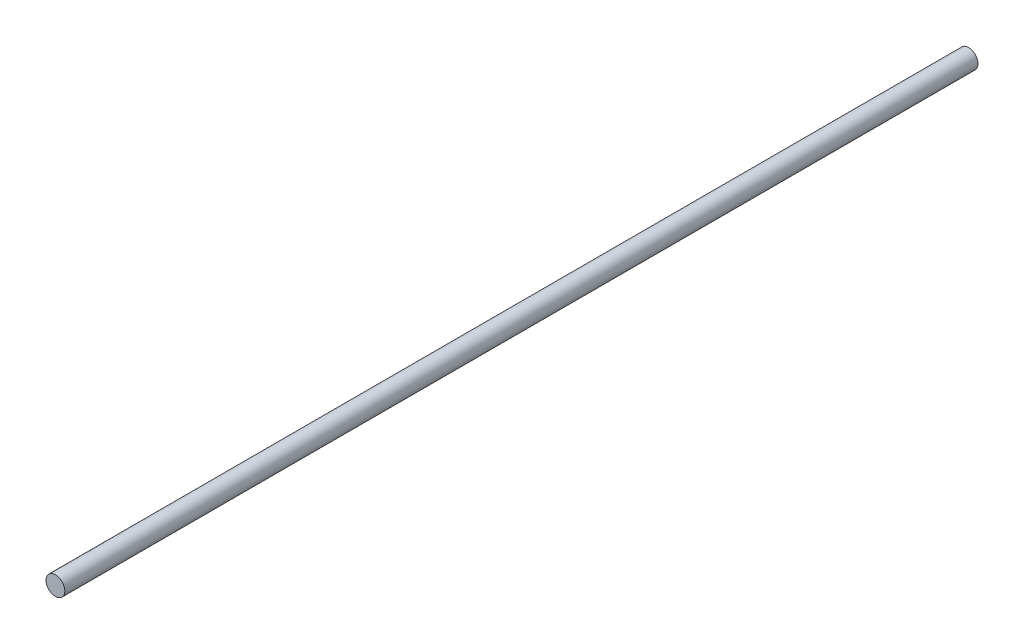
ISO-10303-21;
HEADER;
FILE_DESCRIPTION(('STEP AP214'),'2;1');
FILE_NAME('part.step','',(''),(''),'','','');
FILE_SCHEMA(('AUTOMOTIVE_DESIGN { 1 0 10303 214 1 1 1 1 }'));
ENDSEC;
DATA;
#1=APPLICATION_CONTEXT('core data for automotive mechanical design processes');
#2=APPLICATION_PROTOCOL_DEFINITION('international standard','automotive_design',2000,#1);
#3=PRODUCT_CONTEXT('',#1,'mechanical');
#4=PRODUCT('Part','Part','',(#3));
#5=PRODUCT_RELATED_PRODUCT_CATEGORY('part','',(#4));
#6=PRODUCT_DEFINITION_FORMATION('','',#4);
#7=PRODUCT_DEFINITION_CONTEXT('part definition',#1,'design');
#8=PRODUCT_DEFINITION('design','',#6,#7);
#9=PRODUCT_DEFINITION_SHAPE('','',#8);
#10=(LENGTH_UNIT() NAMED_UNIT(*) SI_UNIT(.MILLI.,.METRE.));
#11=(NAMED_UNIT(*) PLANE_ANGLE_UNIT() SI_UNIT($,.RADIAN.));
#12=(NAMED_UNIT(*) SI_UNIT($,.STERADIAN.) SOLID_ANGLE_UNIT());
#13=UNCERTAINTY_MEASURE_WITH_UNIT(LENGTH_MEASURE(1.E-05),#10,'distance_accuracy_value','');
#14=(GEOMETRIC_REPRESENTATION_CONTEXT(3) GLOBAL_UNCERTAINTY_ASSIGNED_CONTEXT((#13)) GLOBAL_UNIT_ASSIGNED_CONTEXT((#10,
#11,#12)) REPRESENTATION_CONTEXT('',''));
#15=CARTESIAN_POINT('',(0.,0.,0.));
#16=DIRECTION('',(0.,0.,1.));
#17=DIRECTION('',(1.,0.,0.));
#18=AXIS2_PLACEMENT_3D('',#15,#16,#17);
#19=CARTESIAN_POINT('',(0.,0.,291.2));
#20=DIRECTION('',(0.,0.,-1.));
#21=DIRECTION('',(-1.,0.,0.));
#22=AXIS2_PLACEMENT_3D('',#19,#20,#21);
#23=CYLINDRICAL_SURFACE('',#22,3.);
#24=CARTESIAN_POINT('',(0.,0.,291.2));
#25=DIRECTION('',(0.,0.,1.));
#26=DIRECTION('',(1.,0.,0.));
#27=AXIS2_PLACEMENT_3D('',#24,#25,#26);
#28=CIRCLE('',#27,3.);
#29=CARTESIAN_POINT('',(3.,0.,291.2));
#30=VERTEX_POINT('',#29);
#31=EDGE_CURVE('E10',#30,#30,#28,.T.);
#32=ORIENTED_EDGE('',*,*,#31,.F.);
#33=EDGE_LOOP('',(#32));
#34=FACE_BOUND('',#33,.T.);
#35=CARTESIAN_POINT('',(0.,0.,0.));
#36=DIRECTION('',(0.,0.,1.));
#37=DIRECTION('',(1.,0.,0.));
#38=AXIS2_PLACEMENT_3D('',#35,#36,#37);
#39=CIRCLE('',#38,3.);
#40=CARTESIAN_POINT('',(3.,0.,0.));
#41=VERTEX_POINT('',#40);
#42=EDGE_CURVE('E36',#41,#41,#39,.T.);
#43=ORIENTED_EDGE('',*,*,#42,.T.);
#44=EDGE_LOOP('',(#43));
#45=FACE_BOUND('',#44,.T.);
#46=ADVANCED_FACE('F33',(#34,#45),#23,.T.);
#47=CARTESIAN_POINT('',(0.,0.,291.2));
#48=DIRECTION('',(0.,0.,1.));
#49=DIRECTION('',(1.,0.,0.));
#50=AXIS2_PLACEMENT_3D('',#47,#48,#49);
#51=PLANE('',#50);
#52=ORIENTED_EDGE('',*,*,#31,.T.);
#53=EDGE_LOOP('',(#52));
#54=FACE_BOUND('',#53,.T.);
#55=ADVANCED_FACE('F48',(#54),#51,.T.);
#56=CARTESIAN_POINT('',(0.,0.,0.));
#57=DIRECTION('',(0.,0.,1.));
#58=DIRECTION('',(1.,0.,0.));
#59=AXIS2_PLACEMENT_3D('',#56,#57,#58);
#60=PLANE('',#59);
#61=ORIENTED_EDGE('',*,*,#42,.F.);
#62=EDGE_LOOP('',(#61));
#63=FACE_BOUND('',#62,.T.);
#64=ADVANCED_FACE('F46',(#63),#60,.F.);
#65=CLOSED_SHELL('',(#46,#55,#64));
#66=MANIFOLD_SOLID_BREP('B2',#65);
#67=ADVANCED_BREP_SHAPE_REPRESENTATION('',(#18,#66),#14);
#68=SHAPE_DEFINITION_REPRESENTATION(#9,#67);
ENDSEC;
END-ISO-10303-21;
